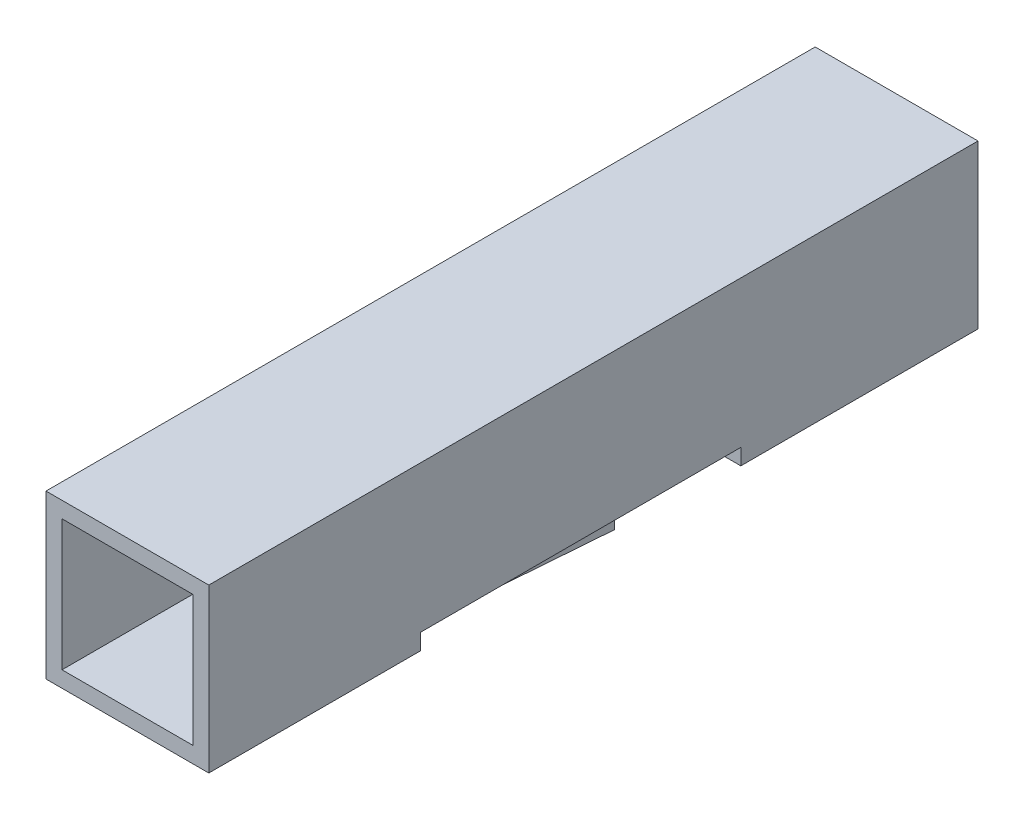
ISO-10303-21;
HEADER;
FILE_DESCRIPTION(('STEP AP214'),'2;1');
FILE_NAME('part.step','',(''),(''),'','','');
FILE_SCHEMA(('AUTOMOTIVE_DESIGN { 1 0 10303 214 1 1 1 1 }'));
ENDSEC;
DATA;
#1=APPLICATION_CONTEXT('core data for automotive mechanical design processes');
#2=APPLICATION_PROTOCOL_DEFINITION('international standard','automotive_design',2000,#1);
#3=PRODUCT_CONTEXT('',#1,'mechanical');
#4=PRODUCT('Part','Part','',(#3));
#5=PRODUCT_RELATED_PRODUCT_CATEGORY('part','',(#4));
#6=PRODUCT_DEFINITION_FORMATION('','',#4);
#7=PRODUCT_DEFINITION_CONTEXT('part definition',#1,'design');
#8=PRODUCT_DEFINITION('design','',#6,#7);
#9=PRODUCT_DEFINITION_SHAPE('','',#8);
#10=(LENGTH_UNIT() NAMED_UNIT(*) SI_UNIT(.MILLI.,.METRE.));
#11=(NAMED_UNIT(*) PLANE_ANGLE_UNIT() SI_UNIT($,.RADIAN.));
#12=(NAMED_UNIT(*) SI_UNIT($,.STERADIAN.) SOLID_ANGLE_UNIT());
#13=UNCERTAINTY_MEASURE_WITH_UNIT(LENGTH_MEASURE(1.E-05),#10,'distance_accuracy_value','');
#14=(GEOMETRIC_REPRESENTATION_CONTEXT(3) GLOBAL_UNCERTAINTY_ASSIGNED_CONTEXT((#13)) GLOBAL_UNIT_ASSIGNED_CONTEXT((#10,
#11,#12)) REPRESENTATION_CONTEXT('',''));
#15=CARTESIAN_POINT('',(0.,0.,0.));
#16=DIRECTION('',(0.,0.,1.));
#17=DIRECTION('',(1.,0.,0.));
#18=AXIS2_PLACEMENT_3D('',#15,#16,#17);
#19=CARTESIAN_POINT('',(-1.27,4.58817260790001,8.7));
#20=DIRECTION('',(0.,0.,1.));
#21=DIRECTION('',(1.,0.,0.));
#22=AXIS2_PLACEMENT_3D('',#19,#20,#21);
#23=PLANE('',#22);
#24=DIRECTION('',(0.,-1.,0.));
#25=VECTOR('',#24,1.);
#26=CARTESIAN_POINT('',(-0.9,-1.02,8.7));
#27=LINE('',#26,#25);
#28=CARTESIAN_POINT('',(-0.9,-1.02,8.7));
#29=VERTEX_POINT('',#28);
#30=CARTESIAN_POINT('',(-0.9,-1.27,8.7));
#31=VERTEX_POINT('',#30);
#32=EDGE_CURVE('E47',#29,#31,#27,.T.);
#33=ORIENTED_EDGE('',*,*,#32,.T.);
#34=DIRECTION('',(-1.,0.,0.));
#35=VECTOR('',#34,1.);
#36=CARTESIAN_POINT('',(-1.27,-1.27,8.7));
#37=LINE('',#36,#35);
#38=CARTESIAN_POINT('',(-1.27,-1.27,8.7));
#39=VERTEX_POINT('',#38);
#40=EDGE_CURVE('E220',#31,#39,#37,.T.);
#41=ORIENTED_EDGE('',*,*,#40,.T.);
#42=DIRECTION('',(0.,-1.,0.));
#43=VECTOR('',#42,1.);
#44=CARTESIAN_POINT('',(-1.27,4.58817260790001,8.7));
#45=LINE('',#44,#43);
#46=CARTESIAN_POINT('',(-1.27,-1.02,8.7));
#47=VERTEX_POINT('',#46);
#48=EDGE_CURVE('E230',#47,#39,#45,.T.);
#49=ORIENTED_EDGE('',*,*,#48,.F.);
#50=DIRECTION('',(1.,0.,0.));
#51=VECTOR('',#50,1.);
#52=CARTESIAN_POINT('',(-1.27,-1.02,8.7));
#53=LINE('',#52,#51);
#54=CARTESIAN_POINT('',(-1.02,-1.02,8.7));
#55=VERTEX_POINT('',#54);
#56=EDGE_CURVE('E231',#47,#55,#53,.T.);
#57=ORIENTED_EDGE('',*,*,#56,.T.);
#58=DIRECTION('',(-1.,0.,0.));
#59=VECTOR('',#58,1.);
#60=CARTESIAN_POINT('',(1.02,-1.02,8.7));
#61=LINE('',#60,#59);
#62=EDGE_CURVE('E40',#29,#55,#61,.T.);
#63=ORIENTED_EDGE('',*,*,#62,.F.);
#64=EDGE_LOOP('',(#33,#41,#49,#57,#63));
#65=FACE_BOUND('',#64,.T.);
#66=ADVANCED_FACE('F32',(#65),#23,.F.);
#67=CARTESIAN_POINT('',(0.,-1.27,12.));
#68=DIRECTION('',(0.,-1.,0.));
#69=DIRECTION('',(1.,0.,0.));
#70=AXIS2_PLACEMENT_3D('',#67,#68,#69);
#71=PLANE('',#70);
#72=CARTESIAN_POINT('',(1.27,-1.27,8.7));
#73=VERTEX_POINT('',#72);
#74=CARTESIAN_POINT('',(0.9,-1.27,8.7));
#75=VERTEX_POINT('',#74);
#76=EDGE_CURVE('E238',#73,#75,#37,.T.);
#77=ORIENTED_EDGE('',*,*,#76,.F.);
#78=DIRECTION('',(0.,0.,-1.));
#79=VECTOR('',#78,1.);
#80=CARTESIAN_POINT('',(1.27,-1.27,12.));
#81=LINE('',#80,#79);
#82=CARTESIAN_POINT('',(1.27,-1.27,12.));
#83=VERTEX_POINT('',#82);
#84=EDGE_CURVE('E339',#83,#73,#81,.T.);
#85=ORIENTED_EDGE('',*,*,#84,.F.);
#86=DIRECTION('',(-1.,0.,0.));
#87=VECTOR('',#86,1.);
#88=CARTESIAN_POINT('',(0.,-1.27,12.));
#89=LINE('',#88,#87);
#90=CARTESIAN_POINT('',(-1.27,-1.27,12.));
#91=VERTEX_POINT('',#90);
#92=EDGE_CURVE('E306',#83,#91,#89,.T.);
#93=ORIENTED_EDGE('',*,*,#92,.T.);
#94=DIRECTION('',(0.,0.,-1.));
#95=VECTOR('',#94,1.);
#96=CARTESIAN_POINT('',(-1.27,-1.27,12.));
#97=LINE('',#96,#95);
#98=EDGE_CURVE('E343',#91,#39,#97,.T.);
#99=ORIENTED_EDGE('',*,*,#98,.T.);
#100=ORIENTED_EDGE('',*,*,#40,.F.);
#101=DIRECTION('',(-1.,0.,0.));
#102=VECTOR('',#101,1.);
#103=CARTESIAN_POINT('',(0.9,-1.27,8.7));
#104=LINE('',#103,#102);
#105=EDGE_CURVE('E54',#75,#31,#104,.T.);
#106=ORIENTED_EDGE('',*,*,#105,.F.);
#107=EDGE_LOOP('',(#77,#85,#93,#99,#100,#106));
#108=FACE_BOUND('',#107,.T.);
#109=ADVANCED_FACE('F435',(#108),#71,.T.);
#110=CARTESIAN_POINT('',(1.02,-1.02,0.5));
#111=DIRECTION('',(0.,-1.,0.));
#112=DIRECTION('',(0.,0.,-1.));
#113=AXIS2_PLACEMENT_3D('',#110,#111,#112);
#114=PLANE('',#113);
#115=DIRECTION('',(0.,0.,1.));
#116=VECTOR('',#115,1.);
#117=CARTESIAN_POINT('',(1.02,-1.02,0.5));
#118=LINE('',#117,#116);
#119=CARTESIAN_POINT('',(1.02,-1.02,8.7));
#120=VERTEX_POINT('',#119);
#121=CARTESIAN_POINT('',(1.02,-1.02,12.));
#122=VERTEX_POINT('',#121);
#123=EDGE_CURVE('E287',#120,#122,#118,.T.);
#124=ORIENTED_EDGE('',*,*,#123,.F.);
#125=CARTESIAN_POINT('',(0.9,-1.02,8.7));
#126=VERTEX_POINT('',#125);
#127=EDGE_CURVE('E11',#120,#126,#61,.T.);
#128=ORIENTED_EDGE('',*,*,#127,.T.);
#129=DIRECTION('',(-1.,0.,0.));
#130=VECTOR('',#129,1.);
#131=CARTESIAN_POINT('',(0.9,-1.02,8.7));
#132=LINE('',#131,#130);
#133=EDGE_CURVE('E222',#126,#29,#132,.T.);
#134=ORIENTED_EDGE('',*,*,#133,.T.);
#135=ORIENTED_EDGE('',*,*,#62,.T.);
#136=DIRECTION('',(0.,0.,1.));
#137=VECTOR('',#136,1.);
#138=CARTESIAN_POINT('',(-1.02,-1.02,0.5));
#139=LINE('',#138,#137);
#140=CARTESIAN_POINT('',(-1.02,-1.02,12.));
#141=VERTEX_POINT('',#140);
#142=EDGE_CURVE('E265',#55,#141,#139,.T.);
#143=ORIENTED_EDGE('',*,*,#142,.T.);
#144=DIRECTION('',(1.,0.,0.));
#145=VECTOR('',#144,1.);
#146=CARTESIAN_POINT('',(1.02,-1.02,12.));
#147=LINE('',#146,#145);
#148=EDGE_CURVE('E269',#141,#122,#147,.T.);
#149=ORIENTED_EDGE('',*,*,#148,.T.);
#150=EDGE_LOOP('',(#124,#128,#134,#135,#143,#149));
#151=FACE_BOUND('',#150,.T.);
#152=ADVANCED_FACE('F381',(#151),#114,.F.);
#153=CARTESIAN_POINT('',(0.,0.570000000000001,12.));
#154=DIRECTION('',(0.,-1.,0.));
#155=DIRECTION('',(0.,0.,-1.));
#156=AXIS2_PLACEMENT_3D('',#153,#154,#155);
#157=PLANE('',#156);
#158=DIRECTION('',(0.,0.,-1.));
#159=VECTOR('',#158,1.);
#160=CARTESIAN_POINT('',(-0.57,0.570000000000001,12.));
#161=LINE('',#160,#159);
#162=CARTESIAN_POINT('',(-0.57,0.570000000000001,0.5));
#163=VERTEX_POINT('',#162);
#164=CARTESIAN_POINT('',(-0.57,0.570000000000001,0.3));
#165=VERTEX_POINT('',#164);
#166=EDGE_CURVE('E323',#163,#165,#161,.T.);
#167=ORIENTED_EDGE('',*,*,#166,.T.);
#168=DIRECTION('',(1.,0.,0.));
#169=VECTOR('',#168,1.);
#170=CARTESIAN_POINT('',(0.57,0.570000000000001,0.3));
#171=LINE('',#170,#169);
#172=CARTESIAN_POINT('',(0.57,0.570000000000001,0.3));
#173=VERTEX_POINT('',#172);
#174=EDGE_CURVE('E365',#165,#173,#171,.T.);
#175=ORIENTED_EDGE('',*,*,#174,.T.);
#176=DIRECTION('',(0.,0.,-1.));
#177=VECTOR('',#176,1.);
#178=CARTESIAN_POINT('',(0.57,0.570000000000001,12.));
#179=LINE('',#178,#177);
#180=CARTESIAN_POINT('',(0.57,0.570000000000001,0.5));
#181=VERTEX_POINT('',#180);
#182=EDGE_CURVE('E333',#181,#173,#179,.T.);
#183=ORIENTED_EDGE('',*,*,#182,.F.);
#184=DIRECTION('',(1.,0.,0.));
#185=VECTOR('',#184,1.);
#186=CARTESIAN_POINT('',(0.,0.570000000000001,0.5));
#187=LINE('',#186,#185);
#188=EDGE_CURVE('E297',#163,#181,#187,.T.);
#189=ORIENTED_EDGE('',*,*,#188,.F.);
#190=EDGE_LOOP('',(#167,#175,#183,#189));
#191=FACE_BOUND('',#190,.T.);
#192=ADVANCED_FACE('F521',(#191),#157,.T.);
#193=CARTESIAN_POINT('',(0.57,0.,12.));
#194=DIRECTION('',(1.,0.,0.));
#195=DIRECTION('',(0.,0.,-1.));
#196=AXIS2_PLACEMENT_3D('',#193,#194,#195);
#197=PLANE('',#196);
#198=ORIENTED_EDGE('',*,*,#182,.T.);
#199=DIRECTION('',(0.,-1.,0.));
#200=VECTOR('',#199,1.);
#201=CARTESIAN_POINT('',(0.57,0.,0.3));
#202=LINE('',#201,#200);
#203=CARTESIAN_POINT('',(0.57,-0.569999999999999,0.3));
#204=VERTEX_POINT('',#203);
#205=EDGE_CURVE('E363',#173,#204,#202,.T.);
#206=ORIENTED_EDGE('',*,*,#205,.T.);
#207=DIRECTION('',(0.,0.,-1.));
#208=VECTOR('',#207,1.);
#209=CARTESIAN_POINT('',(0.57,-0.569999999999999,12.));
#210=LINE('',#209,#208);
#211=CARTESIAN_POINT('',(0.57,-0.569999999999999,0.5));
#212=VERTEX_POINT('',#211);
#213=EDGE_CURVE('E330',#212,#204,#210,.T.);
#214=ORIENTED_EDGE('',*,*,#213,.F.);
#215=DIRECTION('',(0.,1.,0.));
#216=VECTOR('',#215,1.);
#217=CARTESIAN_POINT('',(0.57,0.,0.5));
#218=LINE('',#217,#216);
#219=EDGE_CURVE('E294',#212,#181,#218,.T.);
#220=ORIENTED_EDGE('',*,*,#219,.T.);
#221=EDGE_LOOP('',(#198,#206,#214,#220));
#222=FACE_BOUND('',#221,.T.);
#223=ADVANCED_FACE('F660',(#222),#197,.F.);
#224=CARTESIAN_POINT('',(0.,-0.569999999999999,12.));
#225=DIRECTION('',(0.,-1.,0.));
#226=DIRECTION('',(1.,0.,0.));
#227=AXIS2_PLACEMENT_3D('',#224,#225,#226);
#228=PLANE('',#227);
#229=ORIENTED_EDGE('',*,*,#213,.T.);
#230=DIRECTION('',(-1.,0.,0.));
#231=VECTOR('',#230,1.);
#232=CARTESIAN_POINT('',(0.,-0.569999999999999,0.3));
#233=LINE('',#232,#231);
#234=CARTESIAN_POINT('',(-0.57,-0.569999999999999,0.3));
#235=VERTEX_POINT('',#234);
#236=EDGE_CURVE('E361',#204,#235,#233,.T.);
#237=ORIENTED_EDGE('',*,*,#236,.T.);
#238=DIRECTION('',(0.,0.,-1.));
#239=VECTOR('',#238,1.);
#240=CARTESIAN_POINT('',(-0.57,-0.569999999999999,12.));
#241=LINE('',#240,#239);
#242=CARTESIAN_POINT('',(-0.57,-0.569999999999999,0.5));
#243=VERTEX_POINT('',#242);
#244=EDGE_CURVE('E326',#243,#235,#241,.T.);
#245=ORIENTED_EDGE('',*,*,#244,.F.);
#246=DIRECTION('',(1.,0.,0.));
#247=VECTOR('',#246,1.);
#248=CARTESIAN_POINT('',(0.,-0.569999999999999,0.5));
#249=LINE('',#248,#247);
#250=EDGE_CURVE('E280',#243,#212,#249,.T.);
#251=ORIENTED_EDGE('',*,*,#250,.T.);
#252=EDGE_LOOP('',(#229,#237,#245,#251));
#253=FACE_BOUND('',#252,.T.);
#254=ADVANCED_FACE('F652',(#253),#228,.F.);
#255=CARTESIAN_POINT('',(0.,1.27,12.));
#256=DIRECTION('',(0.,-1.,0.));
#257=DIRECTION('',(0.,0.,-1.));
#258=AXIS2_PLACEMENT_3D('',#255,#256,#257);
#259=PLANE('',#258);
#260=DIRECTION('',(-1.,0.,0.));
#261=VECTOR('',#260,1.);
#262=CARTESIAN_POINT('',(0.,1.27,0.));
#263=LINE('',#262,#261);
#264=CARTESIAN_POINT('',(1.27,1.27,0.));
#265=VERTEX_POINT('',#264);
#266=CARTESIAN_POINT('',(-1.27,1.27,0.));
#267=VERTEX_POINT('',#266);
#268=EDGE_CURVE('E299',#265,#267,#263,.T.);
#269=ORIENTED_EDGE('',*,*,#268,.T.);
#270=DIRECTION('',(0.,0.,-1.));
#271=VECTOR('',#270,1.);
#272=CARTESIAN_POINT('',(-1.27,1.27,12.));
#273=LINE('',#272,#271);
#274=CARTESIAN_POINT('',(-1.27,1.27,12.));
#275=VERTEX_POINT('',#274);
#276=EDGE_CURVE('E327',#275,#267,#273,.T.);
#277=ORIENTED_EDGE('',*,*,#276,.F.);
#278=DIRECTION('',(-1.,0.,0.));
#279=VECTOR('',#278,1.);
#280=CARTESIAN_POINT('',(0.,1.27,12.));
#281=LINE('',#280,#279);
#282=CARTESIAN_POINT('',(1.27,1.27,12.));
#283=VERTEX_POINT('',#282);
#284=EDGE_CURVE('E300',#283,#275,#281,.T.);
#285=ORIENTED_EDGE('',*,*,#284,.F.);
#286=DIRECTION('',(0.,0.,-1.));
#287=VECTOR('',#286,1.);
#288=CARTESIAN_POINT('',(1.27,1.27,12.));
#289=LINE('',#288,#287);
#290=EDGE_CURVE('E312',#283,#265,#289,.T.);
#291=ORIENTED_EDGE('',*,*,#290,.T.);
#292=EDGE_LOOP('',(#269,#277,#285,#291));
#293=FACE_BOUND('',#292,.T.);
#294=ADVANCED_FACE('F644',(#293),#259,.F.);
#295=CARTESIAN_POINT('',(-1.27,0.,12.));
#296=DIRECTION('',(1.,0.,0.));
#297=DIRECTION('',(0.,1.,0.));
#298=AXIS2_PLACEMENT_3D('',#295,#296,#297);
#299=PLANE('',#298);
#300=DIRECTION('',(0.,0.,1.));
#301=VECTOR('',#300,1.);
#302=CARTESIAN_POINT('',(-1.27,-1.02,8.7));
#303=LINE('',#302,#301);
#304=CARTESIAN_POINT('',(-1.27,-1.02,3.7));
#305=VERTEX_POINT('',#304);
#306=EDGE_CURVE('E234',#305,#47,#303,.T.);
#307=ORIENTED_EDGE('',*,*,#306,.T.);
#308=ORIENTED_EDGE('',*,*,#48,.T.);
#309=ORIENTED_EDGE('',*,*,#98,.F.);
#310=DIRECTION('',(0.,-1.,0.));
#311=VECTOR('',#310,1.);
#312=CARTESIAN_POINT('',(-1.27,0.,12.));
#313=LINE('',#312,#311);
#314=EDGE_CURVE('E303',#275,#91,#313,.T.);
#315=ORIENTED_EDGE('',*,*,#314,.F.);
#316=ORIENTED_EDGE('',*,*,#276,.T.);
#317=DIRECTION('',(0.,-1.,0.));
#318=VECTOR('',#317,1.);
#319=CARTESIAN_POINT('',(-1.27,0.,0.));
#320=LINE('',#319,#318);
#321=CARTESIAN_POINT('',(-1.27,-1.27,0.));
#322=VERTEX_POINT('',#321);
#323=EDGE_CURVE('E315',#267,#322,#320,.T.);
#324=ORIENTED_EDGE('',*,*,#323,.T.);
#325=CARTESIAN_POINT('',(-1.27,-1.27,3.7));
#326=VERTEX_POINT('',#325);
#327=EDGE_CURVE('E342',#326,#322,#97,.T.);
#328=ORIENTED_EDGE('',*,*,#327,.F.);
#329=DIRECTION('',(0.,-1.,0.));
#330=VECTOR('',#329,1.);
#331=CARTESIAN_POINT('',(-1.27,4.58817260790001,3.7));
#332=LINE('',#331,#330);
#333=EDGE_CURVE('E240',#305,#326,#332,.T.);
#334=ORIENTED_EDGE('',*,*,#333,.F.);
#335=EDGE_LOOP('',(#307,#308,#309,#315,#316,#324,#328,#334));
#336=FACE_BOUND('',#335,.T.);
#337=ADVANCED_FACE('F637',(#336),#299,.F.);
#338=DIRECTION('',(1.,0.,0.));
#339=VECTOR('',#338,1.);
#340=CARTESIAN_POINT('',(-1.27,-1.27,3.7));
#341=LINE('',#340,#339);
#342=CARTESIAN_POINT('',(1.27,-1.27,3.7));
#343=VERTEX_POINT('',#342);
#344=EDGE_CURVE('E218',#326,#343,#341,.T.);
#345=ORIENTED_EDGE('',*,*,#344,.F.);
#346=ORIENTED_EDGE('',*,*,#327,.T.);
#347=DIRECTION('',(-1.,0.,0.));
#348=VECTOR('',#347,1.);
#349=CARTESIAN_POINT('',(0.,-1.27,0.));
#350=LINE('',#349,#348);
#351=CARTESIAN_POINT('',(1.27,-1.27,0.));
#352=VERTEX_POINT('',#351);
#353=EDGE_CURVE('E318',#352,#322,#350,.T.);
#354=ORIENTED_EDGE('',*,*,#353,.F.);
#355=EDGE_CURVE('E338',#343,#352,#81,.T.);
#356=ORIENTED_EDGE('',*,*,#355,.F.);
#357=EDGE_LOOP('',(#345,#346,#354,#356));
#358=FACE_BOUND('',#357,.T.);
#359=ADVANCED_FACE('F441',(#358),#71,.T.);
#360=CARTESIAN_POINT('',(1.27,0.,12.));
#361=DIRECTION('',(1.,0.,0.));
#362=DIRECTION('',(0.,0.,-1.));
#363=AXIS2_PLACEMENT_3D('',#360,#361,#362);
#364=PLANE('',#363);
#365=DIRECTION('',(0.,-1.,0.));
#366=VECTOR('',#365,1.);
#367=CARTESIAN_POINT('',(1.27,4.58817260790001,8.7));
#368=LINE('',#367,#366);
#369=CARTESIAN_POINT('',(1.27,-1.02,8.7));
#370=VERTEX_POINT('',#369);
#371=EDGE_CURVE('E243',#370,#73,#368,.T.);
#372=ORIENTED_EDGE('',*,*,#371,.F.);
#373=DIRECTION('',(0.,0.,-1.));
#374=VECTOR('',#373,1.);
#375=CARTESIAN_POINT('',(1.27,-1.02,8.7));
#376=LINE('',#375,#374);
#377=CARTESIAN_POINT('',(1.27,-1.02,3.7));
#378=VERTEX_POINT('',#377);
#379=EDGE_CURVE('E226',#370,#378,#376,.T.);
#380=ORIENTED_EDGE('',*,*,#379,.T.);
#381=DIRECTION('',(0.,-1.,0.));
#382=VECTOR('',#381,1.);
#383=CARTESIAN_POINT('',(1.27,4.58817260790001,3.7));
#384=LINE('',#383,#382);
#385=EDGE_CURVE('E245',#378,#343,#384,.T.);
#386=ORIENTED_EDGE('',*,*,#385,.T.);
#387=ORIENTED_EDGE('',*,*,#355,.T.);
#388=DIRECTION('',(0.,-1.,0.));
#389=VECTOR('',#388,1.);
#390=CARTESIAN_POINT('',(1.27,0.,0.));
#391=LINE('',#390,#389);
#392=EDGE_CURVE('E304',#265,#352,#391,.T.);
#393=ORIENTED_EDGE('',*,*,#392,.F.);
#394=ORIENTED_EDGE('',*,*,#290,.F.);
#395=DIRECTION('',(0.,-1.,0.));
#396=VECTOR('',#395,1.);
#397=CARTESIAN_POINT('',(1.27,0.,12.));
#398=LINE('',#397,#396);
#399=EDGE_CURVE('E309',#283,#83,#398,.T.);
#400=ORIENTED_EDGE('',*,*,#399,.T.);
#401=ORIENTED_EDGE('',*,*,#84,.T.);
#402=EDGE_LOOP('',(#372,#380,#386,#387,#393,#394,#400,#401));
#403=FACE_BOUND('',#402,.T.);
#404=ADVANCED_FACE('F620',(#403),#364,.T.);
#405=CARTESIAN_POINT('',(-0.57,0.,12.));
#406=DIRECTION('',(1.,0.,0.));
#407=DIRECTION('',(0.,1.,0.));
#408=AXIS2_PLACEMENT_3D('',#405,#406,#407);
#409=PLANE('',#408);
#410=ORIENTED_EDGE('',*,*,#244,.T.);
#411=DIRECTION('',(0.,1.,0.));
#412=VECTOR('',#411,1.);
#413=CARTESIAN_POINT('',(-0.57,0.570000000000001,0.3));
#414=LINE('',#413,#412);
#415=EDGE_CURVE('E358',#235,#165,#414,.T.);
#416=ORIENTED_EDGE('',*,*,#415,.T.);
#417=ORIENTED_EDGE('',*,*,#166,.F.);
#418=DIRECTION('',(0.,1.,0.));
#419=VECTOR('',#418,1.);
#420=CARTESIAN_POINT('',(-0.57,0.,0.5));
#421=LINE('',#420,#419);
#422=EDGE_CURVE('E336',#243,#163,#421,.T.);
#423=ORIENTED_EDGE('',*,*,#422,.F.);
#424=EDGE_LOOP('',(#410,#416,#417,#423));
#425=FACE_BOUND('',#424,.T.);
#426=ADVANCED_FACE('F612',(#425),#409,.T.);
#427=CARTESIAN_POINT('',(0.,0.,12.));
#428=DIRECTION('',(0.,0.,1.));
#429=DIRECTION('',(1.,0.,0.));
#430=AXIS2_PLACEMENT_3D('',#427,#428,#429);
#431=PLANE('',#430);
#432=DIRECTION('',(0.,-1.,0.));
#433=VECTOR('',#432,1.);
#434=CARTESIAN_POINT('',(-1.02,1.02,12.));
#435=LINE('',#434,#433);
#436=CARTESIAN_POINT('',(-1.02,1.02,12.));
#437=VERTEX_POINT('',#436);
#438=EDGE_CURVE('E266',#437,#141,#435,.T.);
#439=ORIENTED_EDGE('',*,*,#438,.F.);
#440=DIRECTION('',(-1.,0.,0.));
#441=VECTOR('',#440,1.);
#442=CARTESIAN_POINT('',(1.02,1.02,12.));
#443=LINE('',#442,#441);
#444=CARTESIAN_POINT('',(1.02,1.02,12.));
#445=VERTEX_POINT('',#444);
#446=EDGE_CURVE('E256',#445,#437,#443,.T.);
#447=ORIENTED_EDGE('',*,*,#446,.F.);
#448=DIRECTION('',(0.,1.,0.));
#449=VECTOR('',#448,1.);
#450=CARTESIAN_POINT('',(1.02,1.02,12.));
#451=LINE('',#450,#449);
#452=EDGE_CURVE('E273',#122,#445,#451,.T.);
#453=ORIENTED_EDGE('',*,*,#452,.F.);
#454=ORIENTED_EDGE('',*,*,#148,.F.);
#455=EDGE_LOOP('',(#439,#447,#453,#454));
#456=FACE_BOUND('',#455,.T.);
#457=ORIENTED_EDGE('',*,*,#284,.T.);
#458=ORIENTED_EDGE('',*,*,#314,.T.);
#459=ORIENTED_EDGE('',*,*,#92,.F.);
#460=ORIENTED_EDGE('',*,*,#399,.F.);
#461=EDGE_LOOP('',(#457,#458,#459,#460));
#462=FACE_BOUND('',#461,.T.);
#463=ADVANCED_FACE('F398',(#456,#462),#431,.T.);
#464=CARTESIAN_POINT('',(0.,0.,0.));
#465=DIRECTION('',(0.,0.,1.));
#466=DIRECTION('',(1.,0.,0.));
#467=AXIS2_PLACEMENT_3D('',#464,#465,#466);
#468=PLANE('',#467);
#469=DIRECTION('',(-1.,0.,0.));
#470=VECTOR('',#469,1.);
#471=CARTESIAN_POINT('',(-0.57,0.869999999999999,0.));
#472=LINE('',#471,#470);
#473=CARTESIAN_POINT('',(0.869999999999998,0.869999999999999,0.));
#474=VERTEX_POINT('',#473);
#475=CARTESIAN_POINT('',(-0.869999999999998,0.869999999999999,0.));
#476=VERTEX_POINT('',#475);
#477=EDGE_CURVE('E349',#474,#476,#472,.T.);
#478=ORIENTED_EDGE('',*,*,#477,.T.);
#479=DIRECTION('',(0.,-1.,0.));
#480=VECTOR('',#479,1.);
#481=CARTESIAN_POINT('',(-0.869999999999998,-0.569999999999999,0.));
#482=LINE('',#481,#480);
#483=CARTESIAN_POINT('',(-0.869999999999998,-0.869999999999998,0.));
#484=VERTEX_POINT('',#483);
#485=EDGE_CURVE('E355',#476,#484,#482,.T.);
#486=ORIENTED_EDGE('',*,*,#485,.T.);
#487=DIRECTION('',(1.,0.,0.));
#488=VECTOR('',#487,1.);
#489=CARTESIAN_POINT('',(0.,-0.869999999999998,0.));
#490=LINE('',#489,#488);
#491=CARTESIAN_POINT('',(0.869999999999998,-0.869999999999998,0.));
#492=VERTEX_POINT('',#491);
#493=EDGE_CURVE('E353',#484,#492,#490,.T.);
#494=ORIENTED_EDGE('',*,*,#493,.T.);
#495=DIRECTION('',(0.,1.,0.));
#496=VECTOR('',#495,1.);
#497=CARTESIAN_POINT('',(0.869999999999998,0.,0.));
#498=LINE('',#497,#496);
#499=EDGE_CURVE('E351',#492,#474,#498,.T.);
#500=ORIENTED_EDGE('',*,*,#499,.T.);
#501=EDGE_LOOP('',(#478,#486,#494,#500));
#502=FACE_BOUND('',#501,.T.);
#503=ORIENTED_EDGE('',*,*,#268,.F.);
#504=ORIENTED_EDGE('',*,*,#392,.T.);
#505=ORIENTED_EDGE('',*,*,#353,.T.);
#506=ORIENTED_EDGE('',*,*,#323,.F.);
#507=EDGE_LOOP('',(#503,#504,#505,#506));
#508=FACE_BOUND('',#507,.T.);
#509=ADVANCED_FACE('F596',(#502,#508),#468,.F.);
#510=CARTESIAN_POINT('',(-1.02,1.02,0.5));
#511=DIRECTION('',(-1.,0.,0.));
#512=DIRECTION('',(0.,0.,1.));
#513=AXIS2_PLACEMENT_3D('',#510,#511,#512);
#514=PLANE('',#513);
#515=ORIENTED_EDGE('',*,*,#438,.T.);
#516=ORIENTED_EDGE('',*,*,#142,.F.);
#517=CARTESIAN_POINT('',(-1.02,-1.02,3.7));
#518=VERTEX_POINT('',#517);
#519=EDGE_CURVE('E291',#518,#55,#139,.T.);
#520=ORIENTED_EDGE('',*,*,#519,.F.);
#521=CARTESIAN_POINT('',(-1.02,-1.02,0.5));
#522=VERTEX_POINT('',#521);
#523=EDGE_CURVE('E288',#522,#518,#139,.T.);
#524=ORIENTED_EDGE('',*,*,#523,.F.);
#525=DIRECTION('',(0.,-1.,0.));
#526=VECTOR('',#525,1.);
#527=CARTESIAN_POINT('',(-1.02,1.02,0.5));
#528=LINE('',#527,#526);
#529=CARTESIAN_POINT('',(-1.02,1.02,0.5));
#530=VERTEX_POINT('',#529);
#531=EDGE_CURVE('E252',#530,#522,#528,.T.);
#532=ORIENTED_EDGE('',*,*,#531,.F.);
#533=DIRECTION('',(0.,0.,1.));
#534=VECTOR('',#533,1.);
#535=CARTESIAN_POINT('',(-1.02,1.02,0.5));
#536=LINE('',#535,#534);
#537=EDGE_CURVE('E278',#530,#437,#536,.T.);
#538=ORIENTED_EDGE('',*,*,#537,.T.);
#539=EDGE_LOOP('',(#515,#516,#520,#524,#532,#538));
#540=FACE_BOUND('',#539,.T.);
#541=ADVANCED_FACE('F391',(#540),#514,.F.);
#542=CARTESIAN_POINT('',(1.02,1.02,0.5));
#543=DIRECTION('',(0.,1.,0.));
#544=DIRECTION('',(0.,0.,1.));
#545=AXIS2_PLACEMENT_3D('',#542,#543,#544);
#546=PLANE('',#545);
#547=ORIENTED_EDGE('',*,*,#446,.T.);
#548=ORIENTED_EDGE('',*,*,#537,.F.);
#549=DIRECTION('',(-1.,0.,0.));
#550=VECTOR('',#549,1.);
#551=CARTESIAN_POINT('',(1.02,1.02,0.5));
#552=LINE('',#551,#550);
#553=CARTESIAN_POINT('',(1.02,1.02,0.5));
#554=VERTEX_POINT('',#553);
#555=EDGE_CURVE('E262',#554,#530,#552,.T.);
#556=ORIENTED_EDGE('',*,*,#555,.F.);
#557=DIRECTION('',(0.,0.,1.));
#558=VECTOR('',#557,1.);
#559=CARTESIAN_POINT('',(1.02,1.02,0.5));
#560=LINE('',#559,#558);
#561=EDGE_CURVE('E281',#554,#445,#560,.T.);
#562=ORIENTED_EDGE('',*,*,#561,.T.);
#563=EDGE_LOOP('',(#547,#548,#556,#562));
#564=FACE_BOUND('',#563,.T.);
#565=ADVANCED_FACE('F580',(#564),#546,.F.);
#566=CARTESIAN_POINT('',(1.02,1.02,0.5));
#567=DIRECTION('',(1.,0.,0.));
#568=DIRECTION('',(0.,0.,-1.));
#569=AXIS2_PLACEMENT_3D('',#566,#567,#568);
#570=PLANE('',#569);
#571=ORIENTED_EDGE('',*,*,#452,.T.);
#572=ORIENTED_EDGE('',*,*,#561,.F.);
#573=DIRECTION('',(0.,1.,0.));
#574=VECTOR('',#573,1.);
#575=CARTESIAN_POINT('',(1.02,1.02,0.5));
#576=LINE('',#575,#574);
#577=CARTESIAN_POINT('',(1.02,-1.02,0.5));
#578=VERTEX_POINT('',#577);
#579=EDGE_CURVE('E259',#578,#554,#576,.T.);
#580=ORIENTED_EDGE('',*,*,#579,.F.);
#581=CARTESIAN_POINT('',(1.02,-1.02,3.7));
#582=VERTEX_POINT('',#581);
#583=EDGE_CURVE('E283',#578,#582,#118,.T.);
#584=ORIENTED_EDGE('',*,*,#583,.T.);
#585=EDGE_CURVE('E286',#582,#120,#118,.T.);
#586=ORIENTED_EDGE('',*,*,#585,.T.);
#587=ORIENTED_EDGE('',*,*,#123,.T.);
#588=EDGE_LOOP('',(#571,#572,#580,#584,#586,#587));
#589=FACE_BOUND('',#588,.T.);
#590=ADVANCED_FACE('F404',(#589),#570,.F.);
#591=ORIENTED_EDGE('',*,*,#523,.T.);
#592=DIRECTION('',(1.,0.,0.));
#593=VECTOR('',#592,1.);
#594=CARTESIAN_POINT('',(1.02,-1.02,3.7));
#595=LINE('',#594,#593);
#596=EDGE_CURVE('E367',#518,#582,#595,.T.);
#597=ORIENTED_EDGE('',*,*,#596,.T.);
#598=ORIENTED_EDGE('',*,*,#583,.F.);
#599=DIRECTION('',(1.,0.,0.));
#600=VECTOR('',#599,1.);
#601=CARTESIAN_POINT('',(1.02,-1.02,0.5));
#602=LINE('',#601,#600);
#603=EDGE_CURVE('E255',#522,#578,#602,.T.);
#604=ORIENTED_EDGE('',*,*,#603,.F.);
#605=EDGE_LOOP('',(#591,#597,#598,#604));
#606=FACE_BOUND('',#605,.T.);
#607=ADVANCED_FACE('F523',(#606),#114,.F.);
#608=CARTESIAN_POINT('',(0.,0.,0.5));
#609=DIRECTION('',(0.,0.,-1.));
#610=DIRECTION('',(-1.,0.,0.));
#611=AXIS2_PLACEMENT_3D('',#608,#609,#610);
#612=PLANE('',#611);
#613=ORIENTED_EDGE('',*,*,#188,.T.);
#614=ORIENTED_EDGE('',*,*,#219,.F.);
#615=ORIENTED_EDGE('',*,*,#250,.F.);
#616=ORIENTED_EDGE('',*,*,#422,.T.);
#617=EDGE_LOOP('',(#613,#614,#615,#616));
#618=FACE_BOUND('',#617,.T.);
#619=ORIENTED_EDGE('',*,*,#531,.T.);
#620=ORIENTED_EDGE('',*,*,#603,.T.);
#621=ORIENTED_EDGE('',*,*,#579,.T.);
#622=ORIENTED_EDGE('',*,*,#555,.T.);
#623=EDGE_LOOP('',(#619,#620,#621,#622));
#624=FACE_BOUND('',#623,.T.);
#625=ADVANCED_FACE('F556',(#618,#624),#612,.F.);
#626=CARTESIAN_POINT('',(0.57,0.,0.3));
#627=DIRECTION('',(0.70710678118655,0.,0.707106781186545));
#628=DIRECTION('',(0.,-1.,0.));
#629=AXIS2_PLACEMENT_3D('',#626,#627,#628);
#630=PLANE('',#629);
#631=DIRECTION('',(-0.577350269189625,0.577350269189625,0.577350269189628));
#632=VECTOR('',#631,1.);
#633=CARTESIAN_POINT('',(0.380000000000001,-0.38,0.49));
#634=LINE('',#633,#632);
#635=EDGE_CURVE('E371',#204,#492,#634,.F.);
#636=ORIENTED_EDGE('',*,*,#635,.F.);
#637=ORIENTED_EDGE('',*,*,#205,.F.);
#638=DIRECTION('',(0.577350269189625,0.577350269189625,-0.577350269189628));
#639=VECTOR('',#638,1.);
#640=CARTESIAN_POINT('',(0.380000000000001,0.380000000000001,0.490000000000001));
#641=LINE('',#640,#639);
#642=EDGE_CURVE('E270',#474,#173,#641,.F.);
#643=ORIENTED_EDGE('',*,*,#642,.F.);
#644=ORIENTED_EDGE('',*,*,#499,.F.);
#645=EDGE_LOOP('',(#636,#637,#643,#644));
#646=FACE_BOUND('',#645,.T.);
#647=ADVANCED_FACE('F34',(#646),#630,.F.);
#648=CARTESIAN_POINT('',(0.,0.869999999999999,0.));
#649=DIRECTION('',(0.,-0.70710678118655,-0.707106781186545));
#650=DIRECTION('',(1.,0.,0.));
#651=AXIS2_PLACEMENT_3D('',#648,#649,#650);
#652=PLANE('',#651);
#653=ORIENTED_EDGE('',*,*,#642,.T.);
#654=ORIENTED_EDGE('',*,*,#174,.F.);
#655=DIRECTION('',(-0.577350269189625,0.577350269189625,-0.577350269189628));
#656=VECTOR('',#655,1.);
#657=CARTESIAN_POINT('',(-0.58,0.58,0.29));
#658=LINE('',#657,#656);
#659=EDGE_CURVE('E369',#476,#165,#658,.F.);
#660=ORIENTED_EDGE('',*,*,#659,.F.);
#661=ORIENTED_EDGE('',*,*,#477,.F.);
#662=EDGE_LOOP('',(#653,#654,#660,#661));
#663=FACE_BOUND('',#662,.T.);
#664=ADVANCED_FACE('F540',(#663),#652,.T.);
#665=CARTESIAN_POINT('',(0.,-0.569999999999999,0.3));
#666=DIRECTION('',(0.,-0.70710678118655,0.707106781186545));
#667=DIRECTION('',(-1.,0.,0.));
#668=AXIS2_PLACEMENT_3D('',#665,#666,#667);
#669=PLANE('',#668);
#670=ORIENTED_EDGE('',*,*,#635,.T.);
#671=ORIENTED_EDGE('',*,*,#493,.F.);
#672=DIRECTION('',(-0.577350269189625,-0.577350269189625,-0.577350269189628));
#673=VECTOR('',#672,1.);
#674=CARTESIAN_POINT('',(-0.58,-0.58,0.29));
#675=LINE('',#674,#673);
#676=EDGE_CURVE('E251',#235,#484,#675,.T.);
#677=ORIENTED_EDGE('',*,*,#676,.F.);
#678=ORIENTED_EDGE('',*,*,#236,.F.);
#679=EDGE_LOOP('',(#670,#671,#677,#678));
#680=FACE_BOUND('',#679,.T.);
#681=ADVANCED_FACE('F530',(#680),#669,.F.);
#682=CARTESIAN_POINT('',(-0.869999999999998,0.,0.));
#683=DIRECTION('',(0.70710678118655,0.,-0.707106781186545));
#684=DIRECTION('',(0.,1.,0.));
#685=AXIS2_PLACEMENT_3D('',#682,#683,#684);
#686=PLANE('',#685);
#687=ORIENTED_EDGE('',*,*,#659,.T.);
#688=ORIENTED_EDGE('',*,*,#415,.F.);
#689=ORIENTED_EDGE('',*,*,#676,.T.);
#690=ORIENTED_EDGE('',*,*,#485,.F.);
#691=EDGE_LOOP('',(#687,#688,#689,#690));
#692=FACE_BOUND('',#691,.T.);
#693=ADVANCED_FACE('F454',(#692),#686,.T.);
#694=CARTESIAN_POINT('',(1.02,-1.02,0.5));
#695=DIRECTION('',(0.,-1.,0.));
#696=DIRECTION('',(0.,0.,-1.));
#697=AXIS2_PLACEMENT_3D('',#694,#695,#696);
#698=PLANE('',#697);
#699=ORIENTED_EDGE('',*,*,#519,.T.);
#700=ORIENTED_EDGE('',*,*,#56,.F.);
#701=ORIENTED_EDGE('',*,*,#306,.F.);
#702=DIRECTION('',(-1.,0.,0.));
#703=VECTOR('',#702,1.);
#704=CARTESIAN_POINT('',(-1.27,-1.02,3.7));
#705=LINE('',#704,#703);
#706=EDGE_CURVE('E236',#518,#305,#705,.T.);
#707=ORIENTED_EDGE('',*,*,#706,.F.);
#708=EDGE_LOOP('',(#699,#700,#701,#707));
#709=FACE_BOUND('',#708,.T.);
#710=ADVANCED_FACE('F387',(#709),#698,.T.);
#711=ORIENTED_EDGE('',*,*,#585,.F.);
#712=EDGE_CURVE('E249',#378,#582,#705,.T.);
#713=ORIENTED_EDGE('',*,*,#712,.F.);
#714=ORIENTED_EDGE('',*,*,#379,.F.);
#715=EDGE_CURVE('E229',#120,#370,#53,.T.);
#716=ORIENTED_EDGE('',*,*,#715,.F.);
#717=EDGE_LOOP('',(#711,#713,#714,#716));
#718=FACE_BOUND('',#717,.T.);
#719=ADVANCED_FACE('F407',(#718),#698,.T.);
#720=ORIENTED_EDGE('',*,*,#76,.T.);
#721=DIRECTION('',(0.,-1.,0.));
#722=VECTOR('',#721,1.);
#723=CARTESIAN_POINT('',(0.9,-1.02,8.7));
#724=LINE('',#723,#722);
#725=EDGE_CURVE('E212',#126,#75,#724,.T.);
#726=ORIENTED_EDGE('',*,*,#725,.F.);
#727=ORIENTED_EDGE('',*,*,#127,.F.);
#728=ORIENTED_EDGE('',*,*,#715,.T.);
#729=ORIENTED_EDGE('',*,*,#371,.T.);
#730=EDGE_LOOP('',(#720,#726,#727,#728,#729));
#731=FACE_BOUND('',#730,.T.);
#732=ADVANCED_FACE('F412',(#731),#23,.F.);
#733=CARTESIAN_POINT('',(-1.27,4.58817260790001,3.7));
#734=DIRECTION('',(0.,0.,-1.));
#735=DIRECTION('',(-1.,0.,0.));
#736=AXIS2_PLACEMENT_3D('',#733,#734,#735);
#737=PLANE('',#736);
#738=ORIENTED_EDGE('',*,*,#712,.T.);
#739=ORIENTED_EDGE('',*,*,#596,.F.);
#740=ORIENTED_EDGE('',*,*,#706,.T.);
#741=ORIENTED_EDGE('',*,*,#333,.T.);
#742=ORIENTED_EDGE('',*,*,#344,.T.);
#743=ORIENTED_EDGE('',*,*,#385,.F.);
#744=EDGE_LOOP('',(#738,#739,#740,#741,#742,#743));
#745=FACE_BOUND('',#744,.T.);
#746=ADVANCED_FACE('F445',(#745),#737,.F.);
#747=CARTESIAN_POINT('',(0.9,-1.27,8.7));
#748=DIRECTION('',(0.,0.997373868518935,-0.0724249017643449));
#749=DIRECTION('',(0.,0.0724249017643449,0.997373868518935));
#750=AXIS2_PLACEMENT_3D('',#747,#748,#749);
#751=PLANE('',#750);
#752=DIRECTION('',(0.,-0.0724249017643449,-0.997373868518935));
#753=VECTOR('',#752,1.);
#754=CARTESIAN_POINT('',(-0.9,-1.27,8.7));
#755=LINE('',#754,#753);
#756=CARTESIAN_POINT('',(-0.9,-1.51689303958248,5.3));
#757=VERTEX_POINT('',#756);
#758=EDGE_CURVE('E217',#31,#757,#755,.T.);
#759=ORIENTED_EDGE('',*,*,#758,.T.);
#760=DIRECTION('',(-1.,0.,0.));
#761=VECTOR('',#760,1.);
#762=CARTESIAN_POINT('',(0.9,-1.51689303958248,5.3));
#763=LINE('',#762,#761);
#764=CARTESIAN_POINT('',(0.9,-1.51689303958248,5.3));
#765=VERTEX_POINT('',#764);
#766=EDGE_CURVE('E199',#765,#757,#763,.T.);
#767=ORIENTED_EDGE('',*,*,#766,.F.);
#768=DIRECTION('',(0.,-0.0724249017643449,-0.997373868518935));
#769=VECTOR('',#768,1.);
#770=CARTESIAN_POINT('',(0.9,-1.27,8.7));
#771=LINE('',#770,#769);
#772=EDGE_CURVE('E207',#75,#765,#771,.T.);
#773=ORIENTED_EDGE('',*,*,#772,.F.);
#774=ORIENTED_EDGE('',*,*,#105,.T.);
#775=EDGE_LOOP('',(#759,#767,#773,#774));
#776=FACE_BOUND('',#775,.T.);
#777=ADVANCED_FACE('F215',(#776),#751,.F.);
#778=CARTESIAN_POINT('',(0.9,-1.51689303958248,5.3));
#779=DIRECTION('',(0.,0.,1.));
#780=DIRECTION('',(1.,0.,0.));
#781=AXIS2_PLACEMENT_3D('',#778,#779,#780);
#782=PLANE('',#781);
#783=DIRECTION('',(0.,1.,0.));
#784=VECTOR('',#783,1.);
#785=CARTESIAN_POINT('',(-0.9,-1.51689303958248,5.3));
#786=LINE('',#785,#784);
#787=CARTESIAN_POINT('',(-0.9,-0.798560216954278,5.3));
#788=VERTEX_POINT('',#787);
#789=EDGE_CURVE('E418',#757,#788,#786,.T.);
#790=ORIENTED_EDGE('',*,*,#789,.T.);
#791=DIRECTION('',(-1.,0.,0.));
#792=VECTOR('',#791,1.);
#793=CARTESIAN_POINT('',(0.9,-0.798560216954278,5.3));
#794=LINE('',#793,#792);
#795=CARTESIAN_POINT('',(0.9,-0.798560216954278,5.3));
#796=VERTEX_POINT('',#795);
#797=EDGE_CURVE('E202',#796,#788,#794,.T.);
#798=ORIENTED_EDGE('',*,*,#797,.F.);
#799=DIRECTION('',(0.,1.,0.));
#800=VECTOR('',#799,1.);
#801=CARTESIAN_POINT('',(0.9,-1.51689303958248,5.3));
#802=LINE('',#801,#800);
#803=EDGE_CURVE('E195',#765,#796,#802,.T.);
#804=ORIENTED_EDGE('',*,*,#803,.F.);
#805=ORIENTED_EDGE('',*,*,#766,.T.);
#806=EDGE_LOOP('',(#790,#798,#804,#805));
#807=FACE_BOUND('',#806,.T.);
#808=ADVANCED_FACE('F197',(#807),#782,.F.);
#809=CARTESIAN_POINT('',(0.9,-0.798560216954278,5.3));
#810=DIRECTION('',(0.,-0.99788580768139,-0.0649916519874628));
#811=DIRECTION('',(0.,0.0649916519874628,-0.99788580768139));
#812=AXIS2_PLACEMENT_3D('',#809,#810,#811);
#813=PLANE('',#812);
#814=DIRECTION('',(0.,-0.0649916519874627,0.99788580768139));
#815=VECTOR('',#814,1.);
#816=CARTESIAN_POINT('',(-0.9,-0.798560216954278,5.3));
#817=LINE('',#816,#815);
#818=EDGE_CURVE('E420',#788,#29,#817,.T.);
#819=ORIENTED_EDGE('',*,*,#818,.T.);
#820=ORIENTED_EDGE('',*,*,#133,.F.);
#821=DIRECTION('',(0.,-0.0649916519874627,0.99788580768139));
#822=VECTOR('',#821,1.);
#823=CARTESIAN_POINT('',(0.9,-0.798560216954278,5.3));
#824=LINE('',#823,#822);
#825=EDGE_CURVE('E206',#796,#126,#824,.T.);
#826=ORIENTED_EDGE('',*,*,#825,.F.);
#827=ORIENTED_EDGE('',*,*,#797,.T.);
#828=EDGE_LOOP('',(#819,#820,#826,#827));
#829=FACE_BOUND('',#828,.T.);
#830=ADVANCED_FACE('F424',(#829),#813,.F.);
#831=CARTESIAN_POINT('',(0.9,0.,0.));
#832=DIRECTION('',(1.,0.,0.));
#833=DIRECTION('',(0.,0.,-1.));
#834=AXIS2_PLACEMENT_3D('',#831,#832,#833);
#835=PLANE('',#834);
#836=ORIENTED_EDGE('',*,*,#772,.T.);
#837=ORIENTED_EDGE('',*,*,#803,.T.);
#838=ORIENTED_EDGE('',*,*,#825,.T.);
#839=ORIENTED_EDGE('',*,*,#725,.T.);
#840=EDGE_LOOP('',(#836,#837,#838,#839));
#841=FACE_BOUND('',#840,.T.);
#842=ADVANCED_FACE('F211',(#841),#835,.T.);
#843=CARTESIAN_POINT('',(-0.9,0.,0.));
#844=DIRECTION('',(1.,0.,0.));
#845=DIRECTION('',(0.,0.,-1.));
#846=AXIS2_PLACEMENT_3D('',#843,#844,#845);
#847=PLANE('',#846);
#848=ORIENTED_EDGE('',*,*,#758,.F.);
#849=ORIENTED_EDGE('',*,*,#32,.F.);
#850=ORIENTED_EDGE('',*,*,#818,.F.);
#851=ORIENTED_EDGE('',*,*,#789,.F.);
#852=EDGE_LOOP('',(#848,#849,#850,#851));
#853=FACE_BOUND('',#852,.T.);
#854=ADVANCED_FACE('F426',(#853),#847,.F.);
#855=CLOSED_SHELL('',(#66,#109,#152,#192,#223,#254,#294,#337,#359,#404,#426,#463,#509,#541,#565,
#590,#607,#625,#647,#664,#681,#693,#710,#719,#732,#746,#777,#808,#830,#842,#854));
#856=MANIFOLD_SOLID_BREP('B2',#855);
#857=ADVANCED_BREP_SHAPE_REPRESENTATION('',(#18,#856),#14);
#858=SHAPE_DEFINITION_REPRESENTATION(#9,#857);
ENDSEC;
END-ISO-10303-21;
